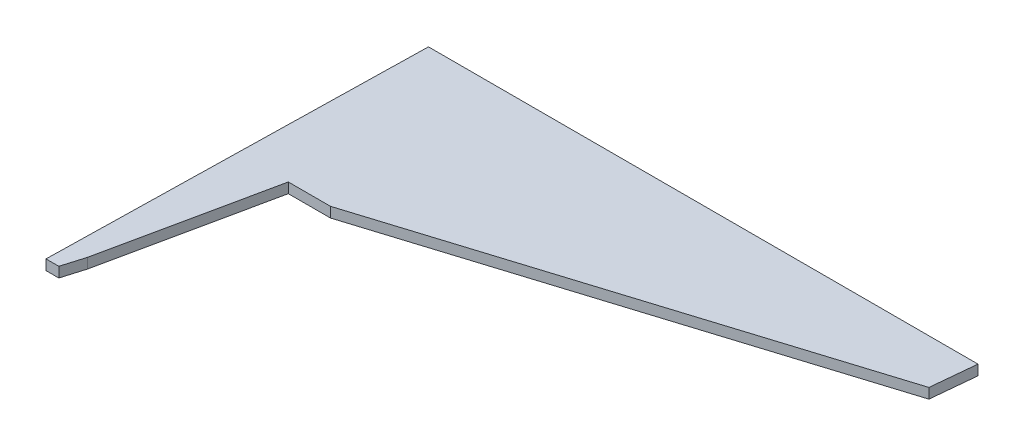
ISO-10303-21;
HEADER;
FILE_DESCRIPTION(('STEP AP214'),'2;1');
FILE_NAME('part.step','',(''),(''),'','','');
FILE_SCHEMA(('AUTOMOTIVE_DESIGN { 1 0 10303 214 1 1 1 1 }'));
ENDSEC;
DATA;
#1=APPLICATION_CONTEXT('core data for automotive mechanical design processes');
#2=APPLICATION_PROTOCOL_DEFINITION('international standard','automotive_design',2000,#1);
#3=PRODUCT_CONTEXT('',#1,'mechanical');
#4=PRODUCT('Part','Part','',(#3));
#5=PRODUCT_RELATED_PRODUCT_CATEGORY('part','',(#4));
#6=PRODUCT_DEFINITION_FORMATION('','',#4);
#7=PRODUCT_DEFINITION_CONTEXT('part definition',#1,'design');
#8=PRODUCT_DEFINITION('design','',#6,#7);
#9=PRODUCT_DEFINITION_SHAPE('','',#8);
#10=(LENGTH_UNIT() NAMED_UNIT(*) SI_UNIT(.MILLI.,.METRE.));
#11=(NAMED_UNIT(*) PLANE_ANGLE_UNIT() SI_UNIT($,.RADIAN.));
#12=(NAMED_UNIT(*) SI_UNIT($,.STERADIAN.) SOLID_ANGLE_UNIT());
#13=UNCERTAINTY_MEASURE_WITH_UNIT(LENGTH_MEASURE(1.E-05),#10,'distance_accuracy_value','');
#14=(GEOMETRIC_REPRESENTATION_CONTEXT(3) GLOBAL_UNCERTAINTY_ASSIGNED_CONTEXT((#13)) GLOBAL_UNIT_ASSIGNED_CONTEXT((#10,
#11,#12)) REPRESENTATION_CONTEXT('',''));
#15=CARTESIAN_POINT('',(0.,0.,0.));
#16=DIRECTION('',(0.,0.,1.));
#17=DIRECTION('',(1.,0.,0.));
#18=AXIS2_PLACEMENT_3D('',#15,#16,#17);
#19=CARTESIAN_POINT('',(109.503026099722,2.,-73.6789499794153));
#20=DIRECTION('',(0.,0.,1.));
#21=DIRECTION('',(1.,0.,0.));
#22=AXIS2_PLACEMENT_3D('',#19,#20,#21);
#23=PLANE('',#22);
#24=DIRECTION('',(-1.,0.,0.));
#25=VECTOR('',#24,1.);
#26=CARTESIAN_POINT('',(109.503026099722,0.,-73.6789499794153));
#27=LINE('',#26,#25);
#28=CARTESIAN_POINT('',(109.503026099722,0.,-73.6789499794153));
#29=VERTEX_POINT('',#28);
#30=CARTESIAN_POINT('',(1.49455648858307,0.,-73.6789499794153));
#31=VERTEX_POINT('',#30);
#32=EDGE_CURVE('E140',#29,#31,#27,.T.);
#33=ORIENTED_EDGE('',*,*,#32,.T.);
#34=DIRECTION('',(0.,-1.,0.));
#35=VECTOR('',#34,1.);
#36=CARTESIAN_POINT('',(1.49455648858307,2.,-73.6789499794153));
#37=LINE('',#36,#35);
#38=CARTESIAN_POINT('',(1.49455648858307,2.,-73.6789499794153));
#39=VERTEX_POINT('',#38);
#40=EDGE_CURVE('E11',#39,#31,#37,.T.);
#41=ORIENTED_EDGE('',*,*,#40,.F.);
#42=DIRECTION('',(-1.,0.,0.));
#43=VECTOR('',#42,1.);
#44=CARTESIAN_POINT('',(109.503026099722,2.,-73.6789499794153));
#45=LINE('',#44,#43);
#46=CARTESIAN_POINT('',(109.503026099722,2.,-73.6789499794153));
#47=VERTEX_POINT('',#46);
#48=EDGE_CURVE('E162',#47,#39,#45,.T.);
#49=ORIENTED_EDGE('',*,*,#48,.F.);
#50=DIRECTION('',(0.,-1.,0.));
#51=VECTOR('',#50,1.);
#52=CARTESIAN_POINT('',(109.503026099722,2.,-73.6789499794153));
#53=LINE('',#52,#51);
#54=EDGE_CURVE('E136',#47,#29,#53,.T.);
#55=ORIENTED_EDGE('',*,*,#54,.T.);
#56=EDGE_LOOP('',(#33,#41,#49,#55));
#57=FACE_BOUND('',#56,.T.);
#58=ADVANCED_FACE('F39',(#57),#23,.F.);
#59=CARTESIAN_POINT('',(1.49455648858307,2.,-73.6789499794153));
#60=DIRECTION('',(0.999794328640798,0.,0.0202805428353163));
#61=DIRECTION('',(0.0202805428353163,0.,-0.999794328640798));
#62=AXIS2_PLACEMENT_3D('',#59,#60,#61);
#63=PLANE('',#62);
#64=DIRECTION('',(-0.0202805428353163,0.,0.999794328640799));
#65=VECTOR('',#64,1.);
#66=CARTESIAN_POINT('',(1.49455648858307,0.,-73.6789499794153));
#67=LINE('',#66,#65);
#68=CARTESIAN_POINT('',(0.,0.,0.));
#69=VERTEX_POINT('',#68);
#70=EDGE_CURVE('E144',#31,#69,#67,.T.);
#71=ORIENTED_EDGE('',*,*,#70,.T.);
#72=DIRECTION('',(0.,-1.,0.));
#73=VECTOR('',#72,1.);
#74=CARTESIAN_POINT('',(0.,2.,0.));
#75=LINE('',#74,#73);
#76=CARTESIAN_POINT('',(0.,2.,0.));
#77=VERTEX_POINT('',#76);
#78=EDGE_CURVE('E48',#77,#69,#75,.T.);
#79=ORIENTED_EDGE('',*,*,#78,.F.);
#80=DIRECTION('',(-0.0202805428353163,0.,0.999794328640799));
#81=VECTOR('',#80,1.);
#82=CARTESIAN_POINT('',(1.49455648858307,2.,-73.6789499794153));
#83=LINE('',#82,#81);
#84=EDGE_CURVE('E99',#39,#77,#83,.T.);
#85=ORIENTED_EDGE('',*,*,#84,.F.);
#86=ORIENTED_EDGE('',*,*,#40,.T.);
#87=EDGE_LOOP('',(#71,#79,#85,#86));
#88=FACE_BOUND('',#87,.T.);
#89=ADVANCED_FACE('F208',(#88),#63,.F.);
#90=CARTESIAN_POINT('',(0.,2.,0.));
#91=DIRECTION('',(0.,0.,-1.));
#92=DIRECTION('',(-1.,0.,0.));
#93=AXIS2_PLACEMENT_3D('',#90,#91,#92);
#94=PLANE('',#93);
#95=DIRECTION('',(1.,0.,0.));
#96=VECTOR('',#95,1.);
#97=CARTESIAN_POINT('',(0.,0.,0.));
#98=LINE('',#97,#96);
#99=CARTESIAN_POINT('',(2.5194770837868,0.,0.));
#100=VERTEX_POINT('',#99);
#101=EDGE_CURVE('E147',#69,#100,#98,.T.);
#102=ORIENTED_EDGE('',*,*,#101,.T.);
#103=DIRECTION('',(0.,-1.,0.));
#104=VECTOR('',#103,1.);
#105=CARTESIAN_POINT('',(2.5194770837868,2.,0.));
#106=LINE('',#105,#104);
#107=CARTESIAN_POINT('',(2.5194770837868,2.,0.));
#108=VERTEX_POINT('',#107);
#109=EDGE_CURVE('E173',#108,#100,#106,.T.);
#110=ORIENTED_EDGE('',*,*,#109,.F.);
#111=DIRECTION('',(1.,0.,0.));
#112=VECTOR('',#111,1.);
#113=CARTESIAN_POINT('',(0.,2.,0.));
#114=LINE('',#113,#112);
#115=EDGE_CURVE('E183',#77,#108,#114,.T.);
#116=ORIENTED_EDGE('',*,*,#115,.F.);
#117=ORIENTED_EDGE('',*,*,#78,.T.);
#118=EDGE_LOOP('',(#102,#110,#116,#117));
#119=FACE_BOUND('',#118,.T.);
#120=ADVANCED_FACE('F181',(#119),#94,.F.);
#121=CARTESIAN_POINT('',(2.5194770837868,2.,0.));
#122=DIRECTION('',(-0.958346789234917,0.,-0.285607127997754));
#123=DIRECTION('',(-0.285607127997754,0.,0.958346789234917));
#124=AXIS2_PLACEMENT_3D('',#121,#122,#123);
#125=PLANE('',#124);
#126=DIRECTION('',(0.285607127997754,0.,-0.958346789234917));
#127=VECTOR('',#126,1.);
#128=CARTESIAN_POINT('',(2.5194770837868,0.,0.));
#129=LINE('',#128,#127);
#130=CARTESIAN_POINT('',(3.80887222941756,0.,-4.32652961616575));
#131=VERTEX_POINT('',#130);
#132=EDGE_CURVE('E150',#100,#131,#129,.T.);
#133=ORIENTED_EDGE('',*,*,#132,.T.);
#134=DIRECTION('',(0.,-1.,0.));
#135=VECTOR('',#134,1.);
#136=CARTESIAN_POINT('',(3.80887222941756,2.,-4.32652961616575));
#137=LINE('',#136,#135);
#138=CARTESIAN_POINT('',(3.80887222941756,2.,-4.32652961616575));
#139=VERTEX_POINT('',#138);
#140=EDGE_CURVE('E169',#139,#131,#137,.T.);
#141=ORIENTED_EDGE('',*,*,#140,.F.);
#142=DIRECTION('',(0.285607127997754,0.,-0.958346789234917));
#143=VECTOR('',#142,1.);
#144=CARTESIAN_POINT('',(2.5194770837868,2.,0.));
#145=LINE('',#144,#143);
#146=EDGE_CURVE('E196',#108,#139,#145,.T.);
#147=ORIENTED_EDGE('',*,*,#146,.F.);
#148=ORIENTED_EDGE('',*,*,#109,.T.);
#149=EDGE_LOOP('',(#133,#141,#147,#148));
#150=FACE_BOUND('',#149,.T.);
#151=ADVANCED_FACE('F191',(#150),#125,.F.);
#152=CARTESIAN_POINT('',(3.80887222941756,2.,-4.32652961616575));
#153=DIRECTION('',(-0.978217295951208,0.,-0.207583529938928));
#154=DIRECTION('',(-0.207583529938928,0.,0.978217295951208));
#155=AXIS2_PLACEMENT_3D('',#152,#153,#154);
#156=PLANE('',#155);
#157=DIRECTION('',(0.207583529938928,0.,-0.978217295951208));
#158=VECTOR('',#157,1.);
#159=CARTESIAN_POINT('',(3.80887222941756,0.,-4.32652961616575));
#160=LINE('',#159,#158);
#161=CARTESIAN_POINT('',(10.7222180883657,0.,-36.9050029377501));
#162=VERTEX_POINT('',#161);
#163=EDGE_CURVE('E153',#131,#162,#160,.T.);
#164=ORIENTED_EDGE('',*,*,#163,.T.);
#165=DIRECTION('',(0.,-1.,0.));
#166=VECTOR('',#165,1.);
#167=CARTESIAN_POINT('',(10.7222180883657,2.,-36.9050029377501));
#168=LINE('',#167,#166);
#169=CARTESIAN_POINT('',(10.7222180883657,2.,-36.9050029377501));
#170=VERTEX_POINT('',#169);
#171=EDGE_CURVE('E129',#170,#162,#168,.T.);
#172=ORIENTED_EDGE('',*,*,#171,.F.);
#173=DIRECTION('',(0.207583529938928,0.,-0.978217295951208));
#174=VECTOR('',#173,1.);
#175=CARTESIAN_POINT('',(3.80887222941756,2.,-4.32652961616575));
#176=LINE('',#175,#174);
#177=EDGE_CURVE('E118',#139,#170,#176,.T.);
#178=ORIENTED_EDGE('',*,*,#177,.F.);
#179=ORIENTED_EDGE('',*,*,#140,.T.);
#180=EDGE_LOOP('',(#164,#172,#178,#179));
#181=FACE_BOUND('',#180,.T.);
#182=ADVANCED_FACE('F194',(#181),#156,.F.);
#183=CARTESIAN_POINT('',(10.7222180883657,2.,-36.9050029377501));
#184=DIRECTION('',(0.,0.,-1.));
#185=DIRECTION('',(-1.,0.,0.));
#186=AXIS2_PLACEMENT_3D('',#183,#184,#185);
#187=PLANE('',#186);
#188=DIRECTION('',(1.,0.,0.));
#189=VECTOR('',#188,1.);
#190=CARTESIAN_POINT('',(10.7222180883657,0.,-36.9050029377501));
#191=LINE('',#190,#189);
#192=CARTESIAN_POINT('',(19.00363969116,0.,-36.9050029377501));
#193=VERTEX_POINT('',#192);
#194=EDGE_CURVE('E127',#162,#193,#191,.T.);
#195=ORIENTED_EDGE('',*,*,#194,.T.);
#196=DIRECTION('',(0.,-1.,0.));
#197=VECTOR('',#196,1.);
#198=CARTESIAN_POINT('',(19.00363969116,2.,-36.9050029377501));
#199=LINE('',#198,#197);
#200=CARTESIAN_POINT('',(19.00363969116,2.,-36.9050029377501));
#201=VERTEX_POINT('',#200);
#202=EDGE_CURVE('E124',#201,#193,#199,.T.);
#203=ORIENTED_EDGE('',*,*,#202,.F.);
#204=DIRECTION('',(1.,0.,0.));
#205=VECTOR('',#204,1.);
#206=CARTESIAN_POINT('',(10.7222180883657,2.,-36.9050029377501));
#207=LINE('',#206,#205);
#208=EDGE_CURVE('E112',#170,#201,#207,.T.);
#209=ORIENTED_EDGE('',*,*,#208,.F.);
#210=ORIENTED_EDGE('',*,*,#171,.T.);
#211=EDGE_LOOP('',(#195,#203,#209,#210));
#212=FACE_BOUND('',#211,.T.);
#213=ADVANCED_FACE('F125',(#212),#187,.F.);
#214=CARTESIAN_POINT('',(19.00363969116,2.,-36.9050029377501));
#215=DIRECTION('',(-0.297984366237543,0.,-0.954570750378415));
#216=DIRECTION('',(-0.954570750378415,0.,0.297984366237543));
#217=AXIS2_PLACEMENT_3D('',#214,#215,#216);
#218=PLANE('',#217);
#219=DIRECTION('',(0.954570750378415,0.,-0.297984366237543));
#220=VECTOR('',#219,1.);
#221=CARTESIAN_POINT('',(19.00363969116,0.,-36.9050029377501));
#222=LINE('',#221,#220);
#223=CARTESIAN_POINT('',(108.64558027749,0.,-64.8881533153745));
#224=VERTEX_POINT('',#223);
#225=EDGE_CURVE('E85',#193,#224,#222,.T.);
#226=ORIENTED_EDGE('',*,*,#225,.T.);
#227=DIRECTION('',(0.,-1.,0.));
#228=VECTOR('',#227,1.);
#229=CARTESIAN_POINT('',(108.64558027749,2.,-64.8881533153745));
#230=LINE('',#229,#228);
#231=CARTESIAN_POINT('',(108.64558027749,2.,-64.8881533153745));
#232=VERTEX_POINT('',#231);
#233=EDGE_CURVE('E130',#232,#224,#230,.T.);
#234=ORIENTED_EDGE('',*,*,#233,.F.);
#235=DIRECTION('',(0.954570750378415,0.,-0.297984366237543));
#236=VECTOR('',#235,1.);
#237=CARTESIAN_POINT('',(19.00363969116,2.,-36.9050029377501));
#238=LINE('',#237,#236);
#239=EDGE_CURVE('E116',#201,#232,#238,.T.);
#240=ORIENTED_EDGE('',*,*,#239,.F.);
#241=ORIENTED_EDGE('',*,*,#202,.T.);
#242=EDGE_LOOP('',(#226,#234,#240,#241));
#243=FACE_BOUND('',#242,.T.);
#244=ADVANCED_FACE('F132',(#243),#218,.F.);
#245=CARTESIAN_POINT('',(108.64558027749,2.,-64.8881533153745));
#246=DIRECTION('',(-0.995276744054647,0.,-0.0970783330304978));
#247=DIRECTION('',(-0.0970783330304978,0.,0.995276744054647));
#248=AXIS2_PLACEMENT_3D('',#245,#246,#247);
#249=PLANE('',#248);
#250=DIRECTION('',(0.0970783330304978,0.,-0.995276744054647));
#251=VECTOR('',#250,1.);
#252=CARTESIAN_POINT('',(108.64558027749,0.,-64.8881533153745));
#253=LINE('',#252,#251);
#254=EDGE_CURVE('E91',#224,#29,#253,.T.);
#255=ORIENTED_EDGE('',*,*,#254,.T.);
#256=ORIENTED_EDGE('',*,*,#54,.F.);
#257=DIRECTION('',(0.0970783330304978,0.,-0.995276744054647));
#258=VECTOR('',#257,1.);
#259=CARTESIAN_POINT('',(108.64558027749,2.,-64.8881533153745));
#260=LINE('',#259,#258);
#261=EDGE_CURVE('E56',#232,#47,#260,.T.);
#262=ORIENTED_EDGE('',*,*,#261,.F.);
#263=ORIENTED_EDGE('',*,*,#233,.T.);
#264=EDGE_LOOP('',(#255,#256,#262,#263));
#265=FACE_BOUND('',#264,.T.);
#266=ADVANCED_FACE('F224',(#265),#249,.F.);
#267=CARTESIAN_POINT('',(0.,2.,0.));
#268=DIRECTION('',(0.,1.,0.));
#269=DIRECTION('',(0.,0.,1.));
#270=AXIS2_PLACEMENT_3D('',#267,#268,#269);
#271=PLANE('',#270);
#272=ORIENTED_EDGE('',*,*,#48,.T.);
#273=ORIENTED_EDGE('',*,*,#84,.T.);
#274=ORIENTED_EDGE('',*,*,#115,.T.);
#275=ORIENTED_EDGE('',*,*,#146,.T.);
#276=ORIENTED_EDGE('',*,*,#177,.T.);
#277=ORIENTED_EDGE('',*,*,#208,.T.);
#278=ORIENTED_EDGE('',*,*,#239,.T.);
#279=ORIENTED_EDGE('',*,*,#261,.T.);
#280=EDGE_LOOP('',(#272,#273,#274,#275,#276,#277,#278,#279));
#281=FACE_BOUND('',#280,.T.);
#282=ADVANCED_FACE('F114',(#281),#271,.T.);
#283=CARTESIAN_POINT('',(0.,0.,0.));
#284=DIRECTION('',(0.,1.,0.));
#285=DIRECTION('',(0.,0.,1.));
#286=AXIS2_PLACEMENT_3D('',#283,#284,#285);
#287=PLANE('',#286);
#288=ORIENTED_EDGE('',*,*,#32,.F.);
#289=ORIENTED_EDGE('',*,*,#254,.F.);
#290=ORIENTED_EDGE('',*,*,#225,.F.);
#291=ORIENTED_EDGE('',*,*,#194,.F.);
#292=ORIENTED_EDGE('',*,*,#163,.F.);
#293=ORIENTED_EDGE('',*,*,#132,.F.);
#294=ORIENTED_EDGE('',*,*,#101,.F.);
#295=ORIENTED_EDGE('',*,*,#70,.F.);
#296=EDGE_LOOP('',(#288,#289,#290,#291,#292,#293,#294,#295));
#297=FACE_BOUND('',#296,.T.);
#298=ADVANCED_FACE('F187',(#297),#287,.F.);
#299=CLOSED_SHELL('',(#58,#89,#120,#151,#182,#213,#244,#266,#282,#298));
#300=MANIFOLD_SOLID_BREP('B2',#299);
#301=ADVANCED_BREP_SHAPE_REPRESENTATION('',(#18,#300),#14);
#302=SHAPE_DEFINITION_REPRESENTATION(#9,#301);
ENDSEC;
END-ISO-10303-21;
